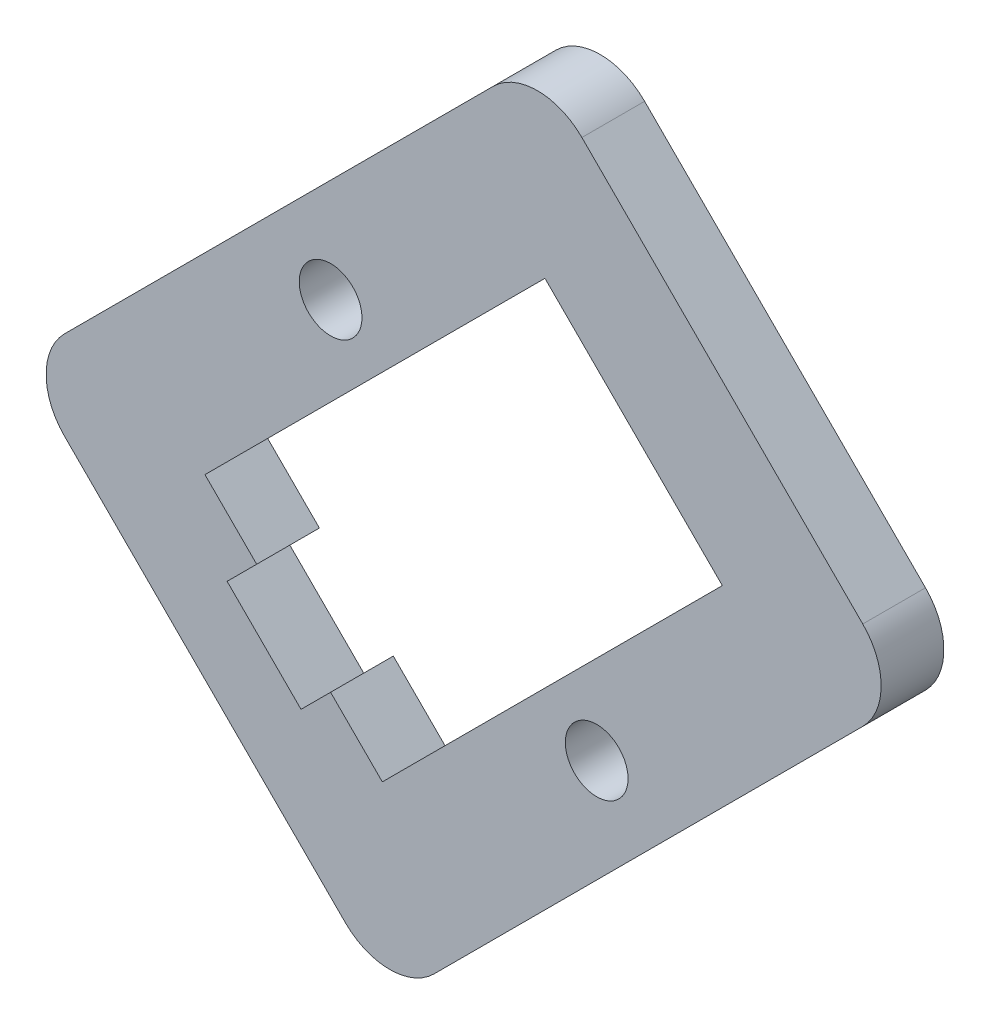
ISO-10303-21;
HEADER;
FILE_DESCRIPTION(('STEP AP214'),'2;1');
FILE_NAME('part.step','',(''),(''),'','','');
FILE_SCHEMA(('AUTOMOTIVE_DESIGN { 1 0 10303 214 1 1 1 1 }'));
ENDSEC;
DATA;
#1=APPLICATION_CONTEXT('core data for automotive mechanical design processes');
#2=APPLICATION_PROTOCOL_DEFINITION('international standard','automotive_design',2000,#1);
#3=PRODUCT_CONTEXT('',#1,'mechanical');
#4=PRODUCT('Part','Part','',(#3));
#5=PRODUCT_RELATED_PRODUCT_CATEGORY('part','',(#4));
#6=PRODUCT_DEFINITION_FORMATION('','',#4);
#7=PRODUCT_DEFINITION_CONTEXT('part definition',#1,'design');
#8=PRODUCT_DEFINITION('design','',#6,#7);
#9=PRODUCT_DEFINITION_SHAPE('','',#8);
#10=(LENGTH_UNIT() NAMED_UNIT(*) SI_UNIT(.MILLI.,.METRE.));
#11=(NAMED_UNIT(*) PLANE_ANGLE_UNIT() SI_UNIT($,.RADIAN.));
#12=(NAMED_UNIT(*) SI_UNIT($,.STERADIAN.) SOLID_ANGLE_UNIT());
#13=UNCERTAINTY_MEASURE_WITH_UNIT(LENGTH_MEASURE(1.E-05),#10,'distance_accuracy_value','');
#14=(GEOMETRIC_REPRESENTATION_CONTEXT(3) GLOBAL_UNCERTAINTY_ASSIGNED_CONTEXT((#13)) GLOBAL_UNIT_ASSIGNED_CONTEXT((#10,
#11,#12)) REPRESENTATION_CONTEXT('',''));
#15=CARTESIAN_POINT('',(0.,0.,0.));
#16=DIRECTION('',(0.,0.,1.));
#17=DIRECTION('',(1.,0.,0.));
#18=AXIS2_PLACEMENT_3D('',#15,#16,#17);
#19=CARTESIAN_POINT('',(360.762914109815,-360.762914109799,3.));
#20=DIRECTION('',(-0.707106781186563,0.707106781186532,0.));
#21=DIRECTION('',(-0.707106781186532,-0.707106781186563,0.));
#22=AXIS2_PLACEMENT_3D('',#19,#20,#21);
#23=PLANE('',#22);
#24=DIRECTION('',(0.707106781186532,0.707106781186563,0.));
#25=VECTOR('',#24,1.);
#26=CARTESIAN_POINT('',(360.762914109815,-360.762914109799,0.));
#27=LINE('',#26,#25);
#28=CARTESIAN_POINT('',(2238.53399627006,1517.00816805052,0.));
#29=VERTEX_POINT('',#28);
#30=CARTESIAN_POINT('',(2259.04009292447,1537.51426470493,0.));
#31=VERTEX_POINT('',#30);
#32=EDGE_CURVE('E219',#29,#31,#27,.T.);
#33=ORIENTED_EDGE('',*,*,#32,.F.);
#34=DIRECTION('',(0.,0.,-1.));
#35=VECTOR('',#34,1.);
#36=CARTESIAN_POINT('',(2238.53399627006,1517.00816805052,3.));
#37=LINE('',#36,#35);
#38=CARTESIAN_POINT('',(2238.53399627006,1517.00816805052,3.));
#39=VERTEX_POINT('',#38);
#40=EDGE_CURVE('E11',#39,#29,#37,.T.);
#41=ORIENTED_EDGE('',*,*,#40,.F.);
#42=DIRECTION('',(0.707106781186532,0.707106781186563,0.));
#43=VECTOR('',#42,1.);
#44=CARTESIAN_POINT('',(360.762914109815,-360.762914109799,3.));
#45=LINE('',#44,#43);
#46=CARTESIAN_POINT('',(2259.04009292447,1537.51426470493,3.));
#47=VERTEX_POINT('',#46);
#48=EDGE_CURVE('E302',#39,#47,#45,.T.);
#49=ORIENTED_EDGE('',*,*,#48,.T.);
#50=DIRECTION('',(0.,0.,-1.));
#51=VECTOR('',#50,1.);
#52=CARTESIAN_POINT('',(2259.04009292447,1537.51426470493,3.));
#53=LINE('',#52,#51);
#54=EDGE_CURVE('E118',#47,#31,#53,.T.);
#55=ORIENTED_EDGE('',*,*,#54,.T.);
#56=EDGE_LOOP('',(#33,#41,#49,#55));
#57=FACE_BOUND('',#56,.T.);
#58=ADVANCED_FACE('F41',(#57),#23,.T.);
#59=CARTESIAN_POINT('',(2240.65531661362,1514.88684770696,3.));
#60=DIRECTION('',(0.,0.,-1.));
#61=DIRECTION('',(-1.,0.,0.));
#62=AXIS2_PLACEMENT_3D('',#59,#60,#61);
#63=CYLINDRICAL_SURFACE('',#62,2.99999999999979);
#64=CARTESIAN_POINT('',(2240.65531661362,1514.88684770696,0.));
#65=DIRECTION('',(0.,0.,1.));
#66=DIRECTION('',(1.,0.,0.));
#67=AXIS2_PLACEMENT_3D('',#64,#65,#66);
#68=CIRCLE('',#67,2.99999999999979);
#69=CARTESIAN_POINT('',(2238.53399627006,1512.7655273634,0.));
#70=VERTEX_POINT('',#69);
#71=EDGE_CURVE('E222',#29,#70,#68,.T.);
#72=ORIENTED_EDGE('',*,*,#71,.T.);
#73=DIRECTION('',(0.,0.,-1.));
#74=VECTOR('',#73,1.);
#75=CARTESIAN_POINT('',(2238.53399627006,1512.7655273634,3.));
#76=LINE('',#75,#74);
#77=CARTESIAN_POINT('',(2238.53399627006,1512.7655273634,3.));
#78=VERTEX_POINT('',#77);
#79=EDGE_CURVE('E51',#78,#70,#76,.T.);
#80=ORIENTED_EDGE('',*,*,#79,.F.);
#81=CARTESIAN_POINT('',(2240.65531661362,1514.88684770696,3.));
#82=DIRECTION('',(0.,0.,1.));
#83=DIRECTION('',(1.,0.,0.));
#84=AXIS2_PLACEMENT_3D('',#81,#82,#83);
#85=CIRCLE('',#84,2.99999999999979);
#86=EDGE_CURVE('E304',#39,#78,#85,.T.);
#87=ORIENTED_EDGE('',*,*,#86,.F.);
#88=ORIENTED_EDGE('',*,*,#40,.T.);
#89=EDGE_LOOP('',(#72,#80,#87,#88));
#90=FACE_BOUND('',#89,.T.);
#91=ADVANCED_FACE('F321',(#90),#63,.T.);
#92=CARTESIAN_POINT('',(1875.64976181681,1875.64976181668,3.));
#93=DIRECTION('',(0.707106781186573,0.707106781186522,0.));
#94=DIRECTION('',(-0.707106781186522,0.707106781186573,0.));
#95=AXIS2_PLACEMENT_3D('',#92,#93,#94);
#96=PLANE('',#95);
#97=DIRECTION('',(0.707106781186522,-0.707106781186573,0.));
#98=VECTOR('',#97,1.);
#99=CARTESIAN_POINT('',(1875.64976181681,1875.64976181668,0.));
#100=LINE('',#99,#98);
#101=CARTESIAN_POINT('',(2251.9690251126,1499.33049852086,0.));
#102=VERTEX_POINT('',#101);
#103=EDGE_CURVE('E225',#70,#102,#100,.T.);
#104=ORIENTED_EDGE('',*,*,#103,.T.);
#105=DIRECTION('',(0.,0.,-1.));
#106=VECTOR('',#105,1.);
#107=CARTESIAN_POINT('',(2251.9690251126,1499.33049852086,3.));
#108=LINE('',#107,#106);
#109=CARTESIAN_POINT('',(2251.9690251126,1499.33049852086,3.));
#110=VERTEX_POINT('',#109);
#111=EDGE_CURVE('E245',#110,#102,#108,.T.);
#112=ORIENTED_EDGE('',*,*,#111,.F.);
#113=DIRECTION('',(0.707106781186522,-0.707106781186573,0.));
#114=VECTOR('',#113,1.);
#115=CARTESIAN_POINT('',(1875.64976181681,1875.64976181668,3.));
#116=LINE('',#115,#114);
#117=EDGE_CURVE('E307',#78,#110,#116,.T.);
#118=ORIENTED_EDGE('',*,*,#117,.F.);
#119=ORIENTED_EDGE('',*,*,#79,.T.);
#120=EDGE_LOOP('',(#104,#112,#118,#119));
#121=FACE_BOUND('',#120,.T.);
#122=ADVANCED_FACE('F323',(#121),#96,.F.);
#123=CARTESIAN_POINT('',(2254.09034545616,1501.45181886442,3.));
#124=DIRECTION('',(0.,0.,-1.));
#125=DIRECTION('',(-1.,0.,0.));
#126=AXIS2_PLACEMENT_3D('',#123,#124,#125);
#127=CYLINDRICAL_SURFACE('',#126,3.00000000000042);
#128=CARTESIAN_POINT('',(2254.09034545616,1501.45181886442,0.));
#129=DIRECTION('',(0.,0.,1.));
#130=DIRECTION('',(1.,0.,0.));
#131=AXIS2_PLACEMENT_3D('',#128,#129,#130);
#132=CIRCLE('',#131,3.00000000000042);
#133=CARTESIAN_POINT('',(2256.21166579972,1499.33049852086,0.));
#134=VERTEX_POINT('',#133);
#135=EDGE_CURVE('E228',#102,#134,#132,.T.);
#136=ORIENTED_EDGE('',*,*,#135,.T.);
#137=DIRECTION('',(0.,0.,-1.));
#138=VECTOR('',#137,1.);
#139=CARTESIAN_POINT('',(2256.21166579972,1499.33049852086,3.));
#140=LINE('',#139,#138);
#141=CARTESIAN_POINT('',(2256.21166579972,1499.33049852086,3.));
#142=VERTEX_POINT('',#141);
#143=EDGE_CURVE('E243',#142,#134,#140,.T.);
#144=ORIENTED_EDGE('',*,*,#143,.F.);
#145=CARTESIAN_POINT('',(2254.09034545616,1501.45181886442,3.));
#146=DIRECTION('',(0.,0.,1.));
#147=DIRECTION('',(1.,0.,0.));
#148=AXIS2_PLACEMENT_3D('',#145,#146,#147);
#149=CIRCLE('',#148,3.00000000000042);
#150=EDGE_CURVE('E310',#110,#142,#149,.T.);
#151=ORIENTED_EDGE('',*,*,#150,.F.);
#152=ORIENTED_EDGE('',*,*,#111,.T.);
#153=EDGE_LOOP('',(#136,#144,#151,#152));
#154=FACE_BOUND('',#153,.T.);
#155=ADVANCED_FACE('F325',(#154),#127,.T.);
#156=CARTESIAN_POINT('',(378.440583639467,-378.440583639455,3.));
#157=DIRECTION('',(0.707106781186559,-0.707106781186536,0.));
#158=DIRECTION('',(0.707106781186536,0.707106781186559,0.));
#159=AXIS2_PLACEMENT_3D('',#156,#157,#158);
#160=PLANE('',#159);
#161=DIRECTION('',(-0.707106781186536,-0.707106781186559,0.));
#162=VECTOR('',#161,1.);
#163=CARTESIAN_POINT('',(378.440583639467,-378.440583639455,0.));
#164=LINE('',#163,#162);
#165=CARTESIAN_POINT('',(2276.71776245413,1519.83659517527,0.));
#166=VERTEX_POINT('',#165);
#167=EDGE_CURVE('E231',#166,#134,#164,.T.);
#168=ORIENTED_EDGE('',*,*,#167,.F.);
#169=DIRECTION('',(0.,0.,-1.));
#170=VECTOR('',#169,1.);
#171=CARTESIAN_POINT('',(2276.71776245413,1519.83659517527,3.));
#172=LINE('',#171,#170);
#173=CARTESIAN_POINT('',(2276.71776245413,1519.83659517527,3.));
#174=VERTEX_POINT('',#173);
#175=EDGE_CURVE('E181',#174,#166,#172,.T.);
#176=ORIENTED_EDGE('',*,*,#175,.F.);
#177=DIRECTION('',(-0.707106781186536,-0.707106781186559,0.));
#178=VECTOR('',#177,1.);
#179=CARTESIAN_POINT('',(378.440583639467,-378.440583639455,3.));
#180=LINE('',#179,#178);
#181=EDGE_CURVE('E170',#174,#142,#180,.T.);
#182=ORIENTED_EDGE('',*,*,#181,.T.);
#183=ORIENTED_EDGE('',*,*,#143,.T.);
#184=EDGE_LOOP('',(#168,#176,#182,#183));
#185=FACE_BOUND('',#184,.T.);
#186=ADVANCED_FACE('F313',(#185),#160,.T.);
#187=CARTESIAN_POINT('',(2274.59644211057,1521.95791551883,3.));
#188=DIRECTION('',(0.,0.,-1.));
#189=DIRECTION('',(-1.,0.,0.));
#190=AXIS2_PLACEMENT_3D('',#187,#188,#189);
#191=CYLINDRICAL_SURFACE('',#190,2.99999999999971);
#192=CARTESIAN_POINT('',(2274.59644211057,1521.95791551883,0.));
#193=DIRECTION('',(0.,0.,1.));
#194=DIRECTION('',(1.,0.,0.));
#195=AXIS2_PLACEMENT_3D('',#192,#193,#194);
#196=CIRCLE('',#195,2.99999999999971);
#197=CARTESIAN_POINT('',(2276.71776245413,1524.07923586239,0.));
#198=VERTEX_POINT('',#197);
#199=EDGE_CURVE('E177',#166,#198,#196,.T.);
#200=ORIENTED_EDGE('',*,*,#199,.T.);
#201=DIRECTION('',(0.,0.,-1.));
#202=VECTOR('',#201,1.);
#203=CARTESIAN_POINT('',(2276.71776245413,1524.07923586239,3.));
#204=LINE('',#203,#202);
#205=CARTESIAN_POINT('',(2276.71776245413,1524.07923586239,3.));
#206=VERTEX_POINT('',#205);
#207=EDGE_CURVE('E174',#206,#198,#204,.T.);
#208=ORIENTED_EDGE('',*,*,#207,.F.);
#209=CARTESIAN_POINT('',(2274.59644211057,1521.95791551883,3.));
#210=DIRECTION('',(0.,0.,1.));
#211=DIRECTION('',(1.,0.,0.));
#212=AXIS2_PLACEMENT_3D('',#209,#210,#211);
#213=CIRCLE('',#212,2.99999999999971);
#214=EDGE_CURVE('E164',#174,#206,#213,.T.);
#215=ORIENTED_EDGE('',*,*,#214,.F.);
#216=ORIENTED_EDGE('',*,*,#175,.T.);
#217=EDGE_LOOP('',(#200,#208,#215,#216));
#218=FACE_BOUND('',#217,.T.);
#219=ADVANCED_FACE('F175',(#218),#191,.T.);
#220=CARTESIAN_POINT('',(1900.39849915828,1900.39849915825,3.));
#221=DIRECTION('',(0.707106781186553,0.707106781186542,0.));
#222=DIRECTION('',(-0.707106781186542,0.707106781186553,0.));
#223=AXIS2_PLACEMENT_3D('',#220,#221,#222);
#224=PLANE('',#223);
#225=DIRECTION('',(0.707106781186542,-0.707106781186553,0.));
#226=VECTOR('',#225,1.);
#227=CARTESIAN_POINT('',(1900.39849915828,1900.39849915825,0.));
#228=LINE('',#227,#226);
#229=CARTESIAN_POINT('',(2263.28273361159,1537.51426470493,0.));
#230=VERTEX_POINT('',#229);
#231=EDGE_CURVE('E235',#230,#198,#228,.T.);
#232=ORIENTED_EDGE('',*,*,#231,.F.);
#233=DIRECTION('',(0.,0.,-1.));
#234=VECTOR('',#233,1.);
#235=CARTESIAN_POINT('',(2263.28273361159,1537.51426470493,3.));
#236=LINE('',#235,#234);
#237=CARTESIAN_POINT('',(2263.28273361159,1537.51426470493,3.));
#238=VERTEX_POINT('',#237);
#239=EDGE_CURVE('E111',#238,#230,#236,.T.);
#240=ORIENTED_EDGE('',*,*,#239,.F.);
#241=DIRECTION('',(0.707106781186542,-0.707106781186553,0.));
#242=VECTOR('',#241,1.);
#243=CARTESIAN_POINT('',(1900.39849915828,1900.39849915825,3.));
#244=LINE('',#243,#242);
#245=EDGE_CURVE('E168',#238,#206,#244,.T.);
#246=ORIENTED_EDGE('',*,*,#245,.T.);
#247=ORIENTED_EDGE('',*,*,#207,.T.);
#248=EDGE_LOOP('',(#232,#240,#246,#247));
#249=FACE_BOUND('',#248,.T.);
#250=ADVANCED_FACE('F183',(#249),#224,.T.);
#251=CARTESIAN_POINT('',(365.359108187556,-365.359108187531,3.));
#252=DIRECTION('',(0.707106781186572,-0.707106781186523,0.));
#253=DIRECTION('',(0.707106781186523,0.707106781186572,0.));
#254=AXIS2_PLACEMENT_3D('',#251,#252,#253);
#255=PLANE('',#254);
#256=DIRECTION('',(-0.707106781186523,-0.707106781186572,0.));
#257=VECTOR('',#256,1.);
#258=CARTESIAN_POINT('',(365.359108187556,-365.359108187531,0.));
#259=LINE('',#258,#257);
#260=CARTESIAN_POINT('',(2261.51496665862,1530.79675028366,0.));
#261=VERTEX_POINT('',#260);
#262=CARTESIAN_POINT('',(2245.25151069133,1514.53329431637,0.));
#263=VERTEX_POINT('',#262);
#264=EDGE_CURVE('E195',#261,#263,#259,.T.);
#265=ORIENTED_EDGE('',*,*,#264,.F.);
#266=DIRECTION('',(0.,0.,-1.));
#267=VECTOR('',#266,1.);
#268=CARTESIAN_POINT('',(2261.51496665862,1530.79675028366,3.));
#269=LINE('',#268,#267);
#270=CARTESIAN_POINT('',(2261.51496665862,1530.79675028366,3.));
#271=VERTEX_POINT('',#270);
#272=EDGE_CURVE('E45',#271,#261,#269,.T.);
#273=ORIENTED_EDGE('',*,*,#272,.F.);
#274=DIRECTION('',(-0.707106781186523,-0.707106781186572,0.));
#275=VECTOR('',#274,1.);
#276=CARTESIAN_POINT('',(365.359108187556,-365.359108187531,3.));
#277=LINE('',#276,#275);
#278=CARTESIAN_POINT('',(2245.25151069133,1514.53329431637,3.));
#279=VERTEX_POINT('',#278);
#280=EDGE_CURVE('E511',#271,#279,#277,.T.);
#281=ORIENTED_EDGE('',*,*,#280,.T.);
#282=DIRECTION('',(0.,0.,-1.));
#283=VECTOR('',#282,1.);
#284=CARTESIAN_POINT('',(2245.25151069133,1514.53329431637,3.));
#285=LINE('',#284,#283);
#286=EDGE_CURVE('E185',#279,#263,#285,.T.);
#287=ORIENTED_EDGE('',*,*,#286,.T.);
#288=EDGE_LOOP('',(#265,#273,#281,#287));
#289=FACE_BOUND('',#288,.T.);
#290=ADVANCED_FACE('F270',(#289),#255,.T.);
#291=CARTESIAN_POINT('',(1896.15585847111,1896.15585847116,3.));
#292=DIRECTION('',(-0.707106781186538,-0.707106781186557,0.));
#293=DIRECTION('',(0.707106781186557,-0.707106781186538,0.));
#294=AXIS2_PLACEMENT_3D('',#291,#292,#293);
#295=PLANE('',#294);
#296=DIRECTION('',(-0.707106781186557,0.707106781186538,0.));
#297=VECTOR('',#296,1.);
#298=CARTESIAN_POINT('',(1896.15585847111,1896.15585847116,0.));
#299=LINE('',#298,#297);
#300=CARTESIAN_POINT('',(2270.00024803286,1522.31146890942,0.));
#301=VERTEX_POINT('',#300);
#302=EDGE_CURVE('E198',#301,#261,#299,.T.);
#303=ORIENTED_EDGE('',*,*,#302,.F.);
#304=DIRECTION('',(0.,0.,-1.));
#305=VECTOR('',#304,1.);
#306=CARTESIAN_POINT('',(2270.00024803286,1522.31146890942,3.));
#307=LINE('',#306,#305);
#308=CARTESIAN_POINT('',(2270.00024803286,1522.31146890942,3.));
#309=VERTEX_POINT('',#308);
#310=EDGE_CURVE('E260',#309,#301,#307,.T.);
#311=ORIENTED_EDGE('',*,*,#310,.F.);
#312=DIRECTION('',(-0.707106781186557,0.707106781186538,0.));
#313=VECTOR('',#312,1.);
#314=CARTESIAN_POINT('',(1896.15585847111,1896.15585847116,3.));
#315=LINE('',#314,#313);
#316=EDGE_CURVE('E269',#309,#271,#315,.T.);
#317=ORIENTED_EDGE('',*,*,#316,.T.);
#318=ORIENTED_EDGE('',*,*,#272,.T.);
#319=EDGE_LOOP('',(#303,#311,#317,#318));
#320=FACE_BOUND('',#319,.T.);
#321=ADVANCED_FACE('F267',(#320),#295,.T.);
#322=CARTESIAN_POINT('',(373.844389561764,-373.844389561749,3.));
#323=DIRECTION('',(-0.707106781186562,0.707106781186533,0.));
#324=DIRECTION('',(-0.707106781186533,-0.707106781186562,0.));
#325=AXIS2_PLACEMENT_3D('',#322,#323,#324);
#326=PLANE('',#325);
#327=DIRECTION('',(0.707106781186533,0.707106781186562,0.));
#328=VECTOR('',#327,1.);
#329=CARTESIAN_POINT('',(373.844389561764,-373.844389561749,0.));
#330=LINE('',#329,#328);
#331=CARTESIAN_POINT('',(2253.73679206557,1506.04801294213,0.));
#332=VERTEX_POINT('',#331);
#333=EDGE_CURVE('E201',#332,#301,#330,.T.);
#334=ORIENTED_EDGE('',*,*,#333,.F.);
#335=DIRECTION('',(0.,0.,-1.));
#336=VECTOR('',#335,1.);
#337=CARTESIAN_POINT('',(2253.73679206557,1506.04801294213,3.));
#338=LINE('',#337,#336);
#339=CARTESIAN_POINT('',(2253.73679206557,1506.04801294213,3.));
#340=VERTEX_POINT('',#339);
#341=EDGE_CURVE('E259',#340,#332,#338,.T.);
#342=ORIENTED_EDGE('',*,*,#341,.F.);
#343=DIRECTION('',(0.707106781186533,0.707106781186562,0.));
#344=VECTOR('',#343,1.);
#345=CARTESIAN_POINT('',(373.844389561764,-373.844389561749,3.));
#346=LINE('',#345,#344);
#347=EDGE_CURVE('E278',#340,#309,#346,.T.);
#348=ORIENTED_EDGE('',*,*,#347,.T.);
#349=ORIENTED_EDGE('',*,*,#310,.T.);
#350=EDGE_LOOP('',(#334,#342,#348,#349));
#351=FACE_BOUND('',#350,.T.);
#352=ADVANCED_FACE('F276',(#351),#326,.T.);
#353=CARTESIAN_POINT('',(1879.89240250395,1879.89240250378,3.));
#354=DIRECTION('',(0.707106781186579,0.707106781186516,0.));
#355=DIRECTION('',(-0.707106781186516,0.707106781186579,0.));
#356=AXIS2_PLACEMENT_3D('',#353,#354,#355);
#357=PLANE('',#356);
#358=DIRECTION('',(0.707106781186516,-0.707106781186579,0.));
#359=VECTOR('',#358,1.);
#360=CARTESIAN_POINT('',(1879.89240250395,1879.89240250378,0.));
#361=LINE('',#360,#359);
#362=CARTESIAN_POINT('',(2251.26191833142,1508.52288667628,0.));
#363=VERTEX_POINT('',#362);
#364=EDGE_CURVE('E204',#363,#332,#361,.T.);
#365=ORIENTED_EDGE('',*,*,#364,.F.);
#366=DIRECTION('',(0.,0.,-1.));
#367=VECTOR('',#366,1.);
#368=CARTESIAN_POINT('',(2251.26191833142,1508.52288667628,3.));
#369=LINE('',#368,#367);
#370=CARTESIAN_POINT('',(2251.26191833142,1508.52288667628,3.));
#371=VERTEX_POINT('',#370);
#372=EDGE_CURVE('E257',#371,#363,#369,.T.);
#373=ORIENTED_EDGE('',*,*,#372,.F.);
#374=DIRECTION('',(0.707106781186516,-0.707106781186579,0.));
#375=VECTOR('',#374,1.);
#376=CARTESIAN_POINT('',(1879.89240250395,1879.89240250378,3.));
#377=LINE('',#376,#375);
#378=EDGE_CURVE('E284',#371,#340,#377,.T.);
#379=ORIENTED_EDGE('',*,*,#378,.T.);
#380=ORIENTED_EDGE('',*,*,#341,.T.);
#381=EDGE_LOOP('',(#365,#373,#379,#380));
#382=FACE_BOUND('',#381,.T.);
#383=ADVANCED_FACE('F287',(#382),#357,.T.);
#384=CARTESIAN_POINT('',(371.369515826858,-371.369515827091,3.));
#385=DIRECTION('',(-0.707106781186325,0.70710678118677,0.));
#386=DIRECTION('',(-0.70710678118677,-0.707106781186326,0.));
#387=AXIS2_PLACEMENT_3D('',#384,#385,#386);
#388=PLANE('',#387);
#389=DIRECTION('',(0.70710678118677,0.707106781186326,0.));
#390=VECTOR('',#389,1.);
#391=CARTESIAN_POINT('',(371.369515826858,-371.369515827091,0.));
#392=LINE('',#391,#390);
#393=CARTESIAN_POINT('',(2249.84763405836,1507.10860240323,0.));
#394=VERTEX_POINT('',#393);
#395=EDGE_CURVE('E207',#394,#363,#392,.T.);
#396=ORIENTED_EDGE('',*,*,#395,.F.);
#397=DIRECTION('',(0.,0.,-1.));
#398=VECTOR('',#397,1.);
#399=CARTESIAN_POINT('',(2249.84763405836,1507.10860240323,3.));
#400=LINE('',#399,#398);
#401=CARTESIAN_POINT('',(2249.84763405836,1507.10860240323,3.));
#402=VERTEX_POINT('',#401);
#403=EDGE_CURVE('E255',#402,#394,#400,.T.);
#404=ORIENTED_EDGE('',*,*,#403,.F.);
#405=DIRECTION('',(0.70710678118677,0.707106781186326,0.));
#406=VECTOR('',#405,1.);
#407=CARTESIAN_POINT('',(371.369515826858,-371.369515827091,3.));
#408=LINE('',#407,#406);
#409=EDGE_CURVE('E288',#402,#371,#408,.T.);
#410=ORIENTED_EDGE('',*,*,#409,.T.);
#411=ORIENTED_EDGE('',*,*,#372,.T.);
#412=EDGE_LOOP('',(#396,#404,#410,#411));
#413=FACE_BOUND('',#412,.T.);
#414=ADVANCED_FACE('F353',(#413),#388,.T.);
#415=CARTESIAN_POINT('',(1878.47811823101,1878.47811823066,3.));
#416=DIRECTION('',(0.707106781186614,0.707106781186481,0.));
#417=DIRECTION('',(-0.707106781186481,0.707106781186614,0.));
#418=AXIS2_PLACEMENT_3D('',#415,#416,#417);
#419=PLANE('',#418);
#420=DIRECTION('',(0.707106781186481,-0.707106781186614,0.));
#421=VECTOR('',#420,1.);
#422=CARTESIAN_POINT('',(1878.47811823101,1878.47811823066,0.));
#423=LINE('',#422,#421);
#424=CARTESIAN_POINT('',(2246.31210015243,1510.64413630917,0.));
#425=VERTEX_POINT('',#424);
#426=EDGE_CURVE('E210',#425,#394,#423,.T.);
#427=ORIENTED_EDGE('',*,*,#426,.F.);
#428=DIRECTION('',(0.,0.,-1.));
#429=VECTOR('',#428,1.);
#430=CARTESIAN_POINT('',(2246.31210015243,1510.64413630917,3.));
#431=LINE('',#430,#429);
#432=CARTESIAN_POINT('',(2246.31210015243,1510.64413630917,3.));
#433=VERTEX_POINT('',#432);
#434=EDGE_CURVE('E253',#433,#425,#431,.T.);
#435=ORIENTED_EDGE('',*,*,#434,.F.);
#436=DIRECTION('',(0.707106781186481,-0.707106781186614,0.));
#437=VECTOR('',#436,1.);
#438=CARTESIAN_POINT('',(1878.47811823101,1878.47811823066,3.));
#439=LINE('',#438,#437);
#440=EDGE_CURVE('E290',#433,#402,#439,.T.);
#441=ORIENTED_EDGE('',*,*,#440,.T.);
#442=ORIENTED_EDGE('',*,*,#403,.T.);
#443=EDGE_LOOP('',(#427,#435,#441,#442));
#444=FACE_BOUND('',#443,.T.);
#445=ADVANCED_FACE('F349',(#444),#419,.T.);
#446=CARTESIAN_POINT('',(367.833981921456,-367.833981921513,3.));
#447=DIRECTION('',(0.707106781186492,-0.707106781186603,0.));
#448=DIRECTION('',(0.707106781186603,0.707106781186492,0.));
#449=AXIS2_PLACEMENT_3D('',#446,#447,#448);
#450=PLANE('',#449);
#451=DIRECTION('',(-0.707106781186603,-0.707106781186492,0.));
#452=VECTOR('',#451,1.);
#453=CARTESIAN_POINT('',(367.833981921456,-367.833981921513,0.));
#454=LINE('',#453,#452);
#455=CARTESIAN_POINT('',(2247.72638442548,1512.05842058222,0.));
#456=VERTEX_POINT('',#455);
#457=EDGE_CURVE('E213',#456,#425,#454,.T.);
#458=ORIENTED_EDGE('',*,*,#457,.F.);
#459=DIRECTION('',(0.,0.,-1.));
#460=VECTOR('',#459,1.);
#461=CARTESIAN_POINT('',(2247.72638442548,1512.05842058222,3.));
#462=LINE('',#461,#460);
#463=CARTESIAN_POINT('',(2247.72638442548,1512.05842058222,3.));
#464=VERTEX_POINT('',#463);
#465=EDGE_CURVE('E251',#464,#456,#462,.T.);
#466=ORIENTED_EDGE('',*,*,#465,.F.);
#467=DIRECTION('',(-0.707106781186603,-0.707106781186492,0.));
#468=VECTOR('',#467,1.);
#469=CARTESIAN_POINT('',(367.833981921456,-367.833981921513,3.));
#470=LINE('',#469,#468);
#471=EDGE_CURVE('E296',#464,#433,#470,.T.);
#472=ORIENTED_EDGE('',*,*,#471,.T.);
#473=ORIENTED_EDGE('',*,*,#434,.T.);
#474=EDGE_LOOP('',(#458,#466,#472,#473));
#475=FACE_BOUND('',#474,.T.);
#476=ADVANCED_FACE('F345',(#475),#450,.T.);
#477=CARTESIAN_POINT('',(1879.89240250365,1879.89240250399,3.));
#478=DIRECTION('',(0.707106781186484,0.707106781186611,0.));
#479=DIRECTION('',(-0.707106781186611,0.707106781186484,0.));
#480=AXIS2_PLACEMENT_3D('',#477,#478,#479);
#481=PLANE('',#480);
#482=DIRECTION('',(0.707106781186611,-0.707106781186484,0.));
#483=VECTOR('',#482,1.);
#484=CARTESIAN_POINT('',(1879.89240250365,1879.89240250399,0.));
#485=LINE('',#484,#483);
#486=EDGE_CURVE('E216',#263,#456,#485,.T.);
#487=ORIENTED_EDGE('',*,*,#486,.F.);
#488=ORIENTED_EDGE('',*,*,#286,.F.);
#489=DIRECTION('',(0.707106781186611,-0.707106781186484,0.));
#490=VECTOR('',#489,1.);
#491=CARTESIAN_POINT('',(1879.89240250365,1879.89240250399,3.));
#492=LINE('',#491,#490);
#493=EDGE_CURVE('E299',#279,#464,#492,.T.);
#494=ORIENTED_EDGE('',*,*,#493,.T.);
#495=ORIENTED_EDGE('',*,*,#465,.T.);
#496=EDGE_LOOP('',(#487,#488,#494,#495));
#497=FACE_BOUND('',#496,.T.);
#498=ADVANCED_FACE('F341',(#497),#481,.T.);
#499=CARTESIAN_POINT('',(2263.98984039513,1512.05842058222,3.));
#500=DIRECTION('',(0.,0.,-1.));
#501=DIRECTION('',(-1.,0.,0.));
#502=AXIS2_PLACEMENT_3D('',#499,#500,#501);
#503=CYLINDRICAL_SURFACE('',#502,1.50000000166674);
#504=CARTESIAN_POINT('',(2263.98984039513,1512.05842058222,3.));
#505=DIRECTION('',(0.,0.,1.));
#506=DIRECTION('',(1.,0.,0.));
#507=AXIS2_PLACEMENT_3D('',#504,#505,#506);
#508=CIRCLE('',#507,1.50000000166674);
#509=CARTESIAN_POINT('',(2265.4898403968,1512.05842058222,3.));
#510=VERTEX_POINT('',#509);
#511=EDGE_CURVE('E374',#510,#510,#508,.T.);
#512=ORIENTED_EDGE('',*,*,#511,.T.);
#513=EDGE_LOOP('',(#512));
#514=FACE_BOUND('',#513,.T.);
#515=CARTESIAN_POINT('',(2263.98984039513,1512.05842058222,0.));
#516=DIRECTION('',(0.,0.,1.));
#517=DIRECTION('',(1.,0.,0.));
#518=AXIS2_PLACEMENT_3D('',#515,#516,#517);
#519=CIRCLE('',#518,1.50000000166674);
#520=CARTESIAN_POINT('',(2265.4898403968,1512.05842058222,0.));
#521=VERTEX_POINT('',#520);
#522=EDGE_CURVE('E192',#521,#521,#519,.T.);
#523=ORIENTED_EDGE('',*,*,#522,.F.);
#524=EDGE_LOOP('',(#523));
#525=FACE_BOUND('',#524,.T.);
#526=ADVANCED_FACE('F344',(#514,#525),#503,.F.);
#527=CARTESIAN_POINT('',(2251.26191833377,1524.78634264358,3.));
#528=DIRECTION('',(0.,0.,-1.));
#529=DIRECTION('',(-1.,0.,0.));
#530=AXIS2_PLACEMENT_3D('',#527,#528,#529);
#531=CYLINDRICAL_SURFACE('',#530,1.50000000166674);
#532=CARTESIAN_POINT('',(2251.26191833377,1524.78634264358,3.));
#533=DIRECTION('',(0.,0.,1.));
#534=DIRECTION('',(1.,0.,0.));
#535=AXIS2_PLACEMENT_3D('',#532,#533,#534);
#536=CIRCLE('',#535,1.50000000166674);
#537=CARTESIAN_POINT('',(2252.76191833544,1524.78634264358,3.));
#538=VERTEX_POINT('',#537);
#539=EDGE_CURVE('E239',#538,#538,#536,.T.);
#540=ORIENTED_EDGE('',*,*,#539,.T.);
#541=EDGE_LOOP('',(#540));
#542=FACE_BOUND('',#541,.T.);
#543=CARTESIAN_POINT('',(2251.26191833377,1524.78634264358,0.));
#544=DIRECTION('',(0.,0.,1.));
#545=DIRECTION('',(1.,0.,0.));
#546=AXIS2_PLACEMENT_3D('',#543,#544,#545);
#547=CIRCLE('',#546,1.50000000166674);
#548=CARTESIAN_POINT('',(2252.76191833544,1524.78634264358,0.));
#549=VERTEX_POINT('',#548);
#550=EDGE_CURVE('E189',#549,#549,#547,.T.);
#551=ORIENTED_EDGE('',*,*,#550,.F.);
#552=EDGE_LOOP('',(#551));
#553=FACE_BOUND('',#552,.T.);
#554=ADVANCED_FACE('F43',(#542,#553),#531,.F.);
#555=CARTESIAN_POINT('',(2261.16141326803,1535.39294436137,3.));
#556=DIRECTION('',(0.,0.,-1.));
#557=DIRECTION('',(-1.,0.,0.));
#558=AXIS2_PLACEMENT_3D('',#555,#556,#557);
#559=CYLINDRICAL_SURFACE('',#558,2.99999999999987);
#560=CARTESIAN_POINT('',(2261.16141326803,1535.39294436137,0.));
#561=DIRECTION('',(0.,0.,1.));
#562=DIRECTION('',(1.,0.,0.));
#563=AXIS2_PLACEMENT_3D('',#560,#561,#562);
#564=CIRCLE('',#563,2.99999999999987);
#565=EDGE_CURVE('E237',#230,#31,#564,.T.);
#566=ORIENTED_EDGE('',*,*,#565,.T.);
#567=ORIENTED_EDGE('',*,*,#54,.F.);
#568=CARTESIAN_POINT('',(2261.16141326803,1535.39294436137,3.));
#569=DIRECTION('',(0.,0.,1.));
#570=DIRECTION('',(1.,0.,0.));
#571=AXIS2_PLACEMENT_3D('',#568,#569,#570);
#572=CIRCLE('',#571,2.99999999999987);
#573=EDGE_CURVE('E60',#238,#47,#572,.T.);
#574=ORIENTED_EDGE('',*,*,#573,.F.);
#575=ORIENTED_EDGE('',*,*,#239,.T.);
#576=EDGE_LOOP('',(#566,#567,#574,#575));
#577=FACE_BOUND('',#576,.T.);
#578=ADVANCED_FACE('F316',(#577),#559,.T.);
#579=CARTESIAN_POINT('',(0.,0.,3.));
#580=DIRECTION('',(0.,0.,1.));
#581=DIRECTION('',(1.,0.,0.));
#582=AXIS2_PLACEMENT_3D('',#579,#580,#581);
#583=PLANE('',#582);
#584=ORIENTED_EDGE('',*,*,#539,.F.);
#585=EDGE_LOOP('',(#584));
#586=FACE_BOUND('',#585,.T.);
#587=ORIENTED_EDGE('',*,*,#511,.F.);
#588=EDGE_LOOP('',(#587));
#589=FACE_BOUND('',#588,.T.);
#590=ORIENTED_EDGE('',*,*,#280,.F.);
#591=ORIENTED_EDGE('',*,*,#316,.F.);
#592=ORIENTED_EDGE('',*,*,#347,.F.);
#593=ORIENTED_EDGE('',*,*,#378,.F.);
#594=ORIENTED_EDGE('',*,*,#409,.F.);
#595=ORIENTED_EDGE('',*,*,#440,.F.);
#596=ORIENTED_EDGE('',*,*,#471,.F.);
#597=ORIENTED_EDGE('',*,*,#493,.F.);
#598=EDGE_LOOP('',(#590,#591,#592,#593,#594,#595,#596,#597));
#599=FACE_BOUND('',#598,.T.);
#600=ORIENTED_EDGE('',*,*,#48,.F.);
#601=ORIENTED_EDGE('',*,*,#86,.T.);
#602=ORIENTED_EDGE('',*,*,#117,.T.);
#603=ORIENTED_EDGE('',*,*,#150,.T.);
#604=ORIENTED_EDGE('',*,*,#181,.F.);
#605=ORIENTED_EDGE('',*,*,#214,.T.);
#606=ORIENTED_EDGE('',*,*,#245,.F.);
#607=ORIENTED_EDGE('',*,*,#573,.T.);
#608=EDGE_LOOP('',(#600,#601,#602,#603,#604,#605,#606,#607));
#609=FACE_BOUND('',#608,.T.);
#610=ADVANCED_FACE('F166',(#586,#589,#599,#609),#583,.T.);
#611=CARTESIAN_POINT('',(0.,0.,0.));
#612=DIRECTION('',(0.,0.,1.));
#613=DIRECTION('',(1.,0.,0.));
#614=AXIS2_PLACEMENT_3D('',#611,#612,#613);
#615=PLANE('',#614);
#616=ORIENTED_EDGE('',*,*,#550,.T.);
#617=EDGE_LOOP('',(#616));
#618=FACE_BOUND('',#617,.T.);
#619=ORIENTED_EDGE('',*,*,#522,.T.);
#620=EDGE_LOOP('',(#619));
#621=FACE_BOUND('',#620,.T.);
#622=ORIENTED_EDGE('',*,*,#264,.T.);
#623=ORIENTED_EDGE('',*,*,#486,.T.);
#624=ORIENTED_EDGE('',*,*,#457,.T.);
#625=ORIENTED_EDGE('',*,*,#426,.T.);
#626=ORIENTED_EDGE('',*,*,#395,.T.);
#627=ORIENTED_EDGE('',*,*,#364,.T.);
#628=ORIENTED_EDGE('',*,*,#333,.T.);
#629=ORIENTED_EDGE('',*,*,#302,.T.);
#630=EDGE_LOOP('',(#622,#623,#624,#625,#626,#627,#628,#629));
#631=FACE_BOUND('',#630,.T.);
#632=ORIENTED_EDGE('',*,*,#32,.T.);
#633=ORIENTED_EDGE('',*,*,#565,.F.);
#634=ORIENTED_EDGE('',*,*,#231,.T.);
#635=ORIENTED_EDGE('',*,*,#199,.F.);
#636=ORIENTED_EDGE('',*,*,#167,.T.);
#637=ORIENTED_EDGE('',*,*,#135,.F.);
#638=ORIENTED_EDGE('',*,*,#103,.F.);
#639=ORIENTED_EDGE('',*,*,#71,.F.);
#640=EDGE_LOOP('',(#632,#633,#634,#635,#636,#637,#638,#639));
#641=FACE_BOUND('',#640,.T.);
#642=ADVANCED_FACE('F273',(#618,#621,#631,#641),#615,.F.);
#643=CLOSED_SHELL('',(#58,#91,#122,#155,#186,#219,#250,#290,#321,#352,#383,#414,#445,#476,#498,
#526,#554,#578,#610,#642));
#644=MANIFOLD_SOLID_BREP('B2',#643);
#645=ADVANCED_BREP_SHAPE_REPRESENTATION('',(#18,#644),#14);
#646=SHAPE_DEFINITION_REPRESENTATION(#9,#645);
ENDSEC;
END-ISO-10303-21;
